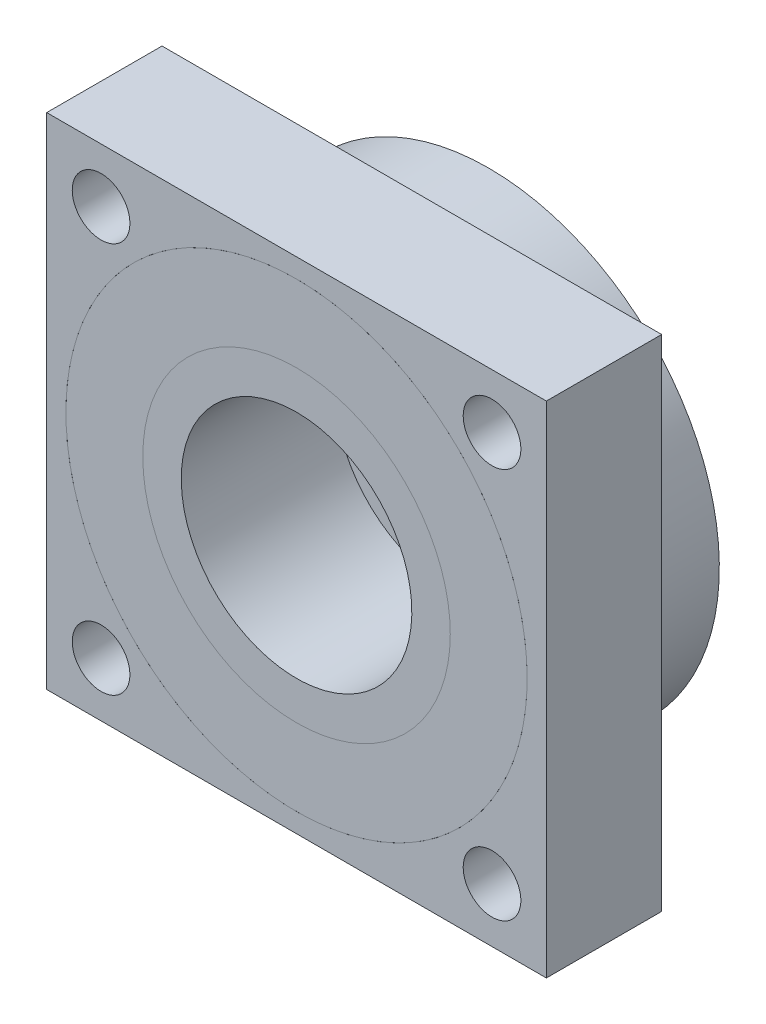
ISO-10303-21;
HEADER;
FILE_DESCRIPTION(('STEP AP214'),'2;1');
FILE_NAME('part.step','',(''),(''),'','','');
FILE_SCHEMA(('AUTOMOTIVE_DESIGN { 1 0 10303 214 1 1 1 1 }'));
ENDSEC;
DATA;
#1=APPLICATION_CONTEXT('core data for automotive mechanical design processes');
#2=APPLICATION_PROTOCOL_DEFINITION('international standard','automotive_design',2000,#1);
#3=PRODUCT_CONTEXT('',#1,'mechanical');
#4=PRODUCT('Part','Part','',(#3));
#5=PRODUCT_RELATED_PRODUCT_CATEGORY('part','',(#4));
#6=PRODUCT_DEFINITION_FORMATION('','',#4);
#7=PRODUCT_DEFINITION_CONTEXT('part definition',#1,'design');
#8=PRODUCT_DEFINITION('design','',#6,#7);
#9=PRODUCT_DEFINITION_SHAPE('','',#8);
#10=(LENGTH_UNIT() NAMED_UNIT(*) SI_UNIT(.MILLI.,.METRE.));
#11=(NAMED_UNIT(*) PLANE_ANGLE_UNIT() SI_UNIT($,.RADIAN.));
#12=(NAMED_UNIT(*) SI_UNIT($,.STERADIAN.) SOLID_ANGLE_UNIT());
#13=UNCERTAINTY_MEASURE_WITH_UNIT(LENGTH_MEASURE(1.E-05),#10,'distance_accuracy_value','');
#14=(GEOMETRIC_REPRESENTATION_CONTEXT(3) GLOBAL_UNCERTAINTY_ASSIGNED_CONTEXT((#13)) GLOBAL_UNIT_ASSIGNED_CONTEXT((#10,
#11,#12)) REPRESENTATION_CONTEXT('',''));
#15=CARTESIAN_POINT('',(0.,0.,0.));
#16=DIRECTION('',(0.,0.,1.));
#17=DIRECTION('',(1.,0.,0.));
#18=AXIS2_PLACEMENT_3D('',#15,#16,#17);
#19=CARTESIAN_POINT('',(0.,0.,-12.7));
#20=DIRECTION('',(0.,0.,-1.));
#21=DIRECTION('',(0.,1.,0.));
#22=AXIS2_PLACEMENT_3D('',#19,#20,#21);
#23=CYLINDRICAL_SURFACE('',#22,7.62);
#24=CARTESIAN_POINT('',(0.,0.,0.));
#25=DIRECTION('',(0.,0.,-1.));
#26=DIRECTION('',(0.,1.,0.));
#27=AXIS2_PLACEMENT_3D('',#24,#25,#26);
#28=CIRCLE('',#27,7.62);
#29=CARTESIAN_POINT('',(0.,7.62,0.));
#30=VERTEX_POINT('',#29);
#31=EDGE_CURVE('E11',#30,#30,#28,.T.);
#32=ORIENTED_EDGE('',*,*,#31,.F.);
#33=EDGE_LOOP('',(#32));
#34=FACE_BOUND('',#33,.T.);
#35=CARTESIAN_POINT('',(0.,0.,-10.16));
#36=DIRECTION('',(0.,0.,-1.));
#37=DIRECTION('',(0.,1.,0.));
#38=AXIS2_PLACEMENT_3D('',#35,#36,#37);
#39=CIRCLE('',#38,7.62);
#40=CARTESIAN_POINT('',(0.,7.62,-10.16));
#41=VERTEX_POINT('',#40);
#42=EDGE_CURVE('E62',#41,#41,#39,.T.);
#43=ORIENTED_EDGE('',*,*,#42,.T.);
#44=EDGE_LOOP('',(#43));
#45=FACE_BOUND('',#44,.T.);
#46=ADVANCED_FACE('F47',(#34,#45),#23,.F.);
#47=CARTESIAN_POINT('',(0.,0.,0.));
#48=DIRECTION('',(0.,0.,1.));
#49=DIRECTION('',(0.,-1.,0.));
#50=AXIS2_PLACEMENT_3D('',#47,#48,#49);
#51=PLANE('',#50);
#52=ORIENTED_EDGE('',*,*,#31,.T.);
#53=EDGE_LOOP('',(#52));
#54=FACE_BOUND('',#53,.T.);
#55=CARTESIAN_POINT('',(0.,0.,0.));
#56=DIRECTION('',(0.,0.,-1.));
#57=DIRECTION('',(0.,1.,0.));
#58=AXIS2_PLACEMENT_3D('',#55,#56,#57);
#59=CIRCLE('',#58,10.16);
#60=CARTESIAN_POINT('',(0.,10.16,0.));
#61=VERTEX_POINT('',#60);
#62=EDGE_CURVE('E58',#61,#61,#59,.T.);
#63=ORIENTED_EDGE('',*,*,#62,.F.);
#64=EDGE_LOOP('',(#63));
#65=FACE_BOUND('',#64,.T.);
#66=ADVANCED_FACE('F49',(#54,#65),#51,.T.);
#67=CARTESIAN_POINT('',(0.,0.,-12.7));
#68=DIRECTION('',(0.,0.,-1.));
#69=DIRECTION('',(0.,1.,0.));
#70=AXIS2_PLACEMENT_3D('',#67,#68,#69);
#71=PLANE('',#70);
#72=CARTESIAN_POINT('',(0.,0.,-12.7));
#73=DIRECTION('',(0.,0.,-1.));
#74=DIRECTION('',(0.,1.,0.));
#75=AXIS2_PLACEMENT_3D('',#72,#73,#74);
#76=CIRCLE('',#75,10.16);
#77=CARTESIAN_POINT('',(0.,10.16,-12.7));
#78=VERTEX_POINT('',#77);
#79=EDGE_CURVE('E54',#78,#78,#76,.T.);
#80=ORIENTED_EDGE('',*,*,#79,.T.);
#81=EDGE_LOOP('',(#80));
#82=FACE_BOUND('',#81,.T.);
#83=ADVANCED_FACE('F76',(#82),#71,.T.);
#84=CARTESIAN_POINT('',(0.,0.,-12.7));
#85=DIRECTION('',(0.,0.,-1.));
#86=DIRECTION('',(0.,1.,0.));
#87=AXIS2_PLACEMENT_3D('',#84,#85,#86);
#88=CYLINDRICAL_SURFACE('',#87,10.16);
#89=ORIENTED_EDGE('',*,*,#79,.F.);
#90=EDGE_LOOP('',(#89));
#91=FACE_BOUND('',#90,.T.);
#92=ORIENTED_EDGE('',*,*,#62,.T.);
#93=EDGE_LOOP('',(#92));
#94=FACE_BOUND('',#93,.T.);
#95=ADVANCED_FACE('F71',(#91,#94),#88,.T.);
#96=CARTESIAN_POINT('',(0.,0.,-10.16));
#97=DIRECTION('',(0.,0.,-1.));
#98=DIRECTION('',(0.,1.,0.));
#99=AXIS2_PLACEMENT_3D('',#96,#97,#98);
#100=PLANE('',#99);
#101=ORIENTED_EDGE('',*,*,#42,.F.);
#102=EDGE_LOOP('',(#101));
#103=FACE_BOUND('',#102,.T.);
#104=ADVANCED_FACE('F69',(#103),#100,.F.);
#105=CLOSED_SHELL('',(#46,#66,#83,#95,#104));
#106=MANIFOLD_SOLID_BREP('B2',#105);
#107=CARTESIAN_POINT('',(16.51,16.51,-7.62));
#108=DIRECTION('',(1.,0.,0.));
#109=DIRECTION('',(0.,1.,0.));
#110=AXIS2_PLACEMENT_3D('',#107,#108,#109);
#111=PLANE('',#110);
#112=DIRECTION('',(0.,1.,0.));
#113=VECTOR('',#112,1.);
#114=CARTESIAN_POINT('',(16.51,16.51,0.));
#115=LINE('',#114,#113);
#116=CARTESIAN_POINT('',(16.51,-16.51,0.));
#117=VERTEX_POINT('',#116);
#118=CARTESIAN_POINT('',(16.51,16.51,0.));
#119=VERTEX_POINT('',#118);
#120=EDGE_CURVE('E196',#117,#119,#115,.T.);
#121=ORIENTED_EDGE('',*,*,#120,.F.);
#122=DIRECTION('',(0.,0.,1.));
#123=VECTOR('',#122,1.);
#124=CARTESIAN_POINT('',(16.51,-16.51,-7.62));
#125=LINE('',#124,#123);
#126=CARTESIAN_POINT('',(16.51,-16.51,-7.62));
#127=VERTEX_POINT('',#126);
#128=EDGE_CURVE('E45',#127,#117,#125,.T.);
#129=ORIENTED_EDGE('',*,*,#128,.F.);
#130=DIRECTION('',(0.,1.,0.));
#131=VECTOR('',#130,1.);
#132=CARTESIAN_POINT('',(16.51,16.51,-7.62));
#133=LINE('',#132,#131);
#134=CARTESIAN_POINT('',(16.51,16.51,-7.62));
#135=VERTEX_POINT('',#134);
#136=EDGE_CURVE('E189',#127,#135,#133,.T.);
#137=ORIENTED_EDGE('',*,*,#136,.T.);
#138=DIRECTION('',(0.,0.,1.));
#139=VECTOR('',#138,1.);
#140=CARTESIAN_POINT('',(16.51,16.51,-7.62));
#141=LINE('',#140,#139);
#142=EDGE_CURVE('E134',#135,#119,#141,.T.);
#143=ORIENTED_EDGE('',*,*,#142,.T.);
#144=EDGE_LOOP('',(#121,#129,#137,#143));
#145=FACE_BOUND('',#144,.T.);
#146=ADVANCED_FACE('F131',(#145),#111,.T.);
#147=CARTESIAN_POINT('',(-16.51,-16.51,-7.62));
#148=DIRECTION('',(0.,-1.,0.));
#149=DIRECTION('',(0.,0.,-1.));
#150=AXIS2_PLACEMENT_3D('',#147,#148,#149);
#151=PLANE('',#150);
#152=DIRECTION('',(1.,0.,0.));
#153=VECTOR('',#152,1.);
#154=CARTESIAN_POINT('',(-16.51,-16.51,0.));
#155=LINE('',#154,#153);
#156=CARTESIAN_POINT('',(-16.51,-16.51,0.));
#157=VERTEX_POINT('',#156);
#158=EDGE_CURVE('E191',#157,#117,#155,.T.);
#159=ORIENTED_EDGE('',*,*,#158,.F.);
#160=DIRECTION('',(0.,0.,1.));
#161=VECTOR('',#160,1.);
#162=CARTESIAN_POINT('',(-16.51,-16.51,-7.62));
#163=LINE('',#162,#161);
#164=CARTESIAN_POINT('',(-16.51,-16.51,-7.62));
#165=VERTEX_POINT('',#164);
#166=EDGE_CURVE('E140',#165,#157,#163,.T.);
#167=ORIENTED_EDGE('',*,*,#166,.F.);
#168=DIRECTION('',(1.,0.,0.));
#169=VECTOR('',#168,1.);
#170=CARTESIAN_POINT('',(-16.51,-16.51,-7.62));
#171=LINE('',#170,#169);
#172=EDGE_CURVE('E186',#165,#127,#171,.T.);
#173=ORIENTED_EDGE('',*,*,#172,.T.);
#174=ORIENTED_EDGE('',*,*,#128,.T.);
#175=EDGE_LOOP('',(#159,#167,#173,#174));
#176=FACE_BOUND('',#175,.T.);
#177=ADVANCED_FACE('F207',(#176),#151,.T.);
#178=CARTESIAN_POINT('',(-16.51,16.51,-7.62));
#179=DIRECTION('',(-1.,0.,0.));
#180=DIRECTION('',(0.,0.,1.));
#181=AXIS2_PLACEMENT_3D('',#178,#179,#180);
#182=PLANE('',#181);
#183=DIRECTION('',(0.,-1.,0.));
#184=VECTOR('',#183,1.);
#185=CARTESIAN_POINT('',(-16.51,16.51,0.));
#186=LINE('',#185,#184);
#187=CARTESIAN_POINT('',(-16.51,16.51,0.));
#188=VERTEX_POINT('',#187);
#189=EDGE_CURVE('E181',#188,#157,#186,.T.);
#190=ORIENTED_EDGE('',*,*,#189,.F.);
#191=DIRECTION('',(0.,0.,1.));
#192=VECTOR('',#191,1.);
#193=CARTESIAN_POINT('',(-16.51,16.51,-7.62));
#194=LINE('',#193,#192);
#195=CARTESIAN_POINT('',(-16.51,16.51,-7.62));
#196=VERTEX_POINT('',#195);
#197=EDGE_CURVE('E176',#196,#188,#194,.T.);
#198=ORIENTED_EDGE('',*,*,#197,.F.);
#199=DIRECTION('',(0.,-1.,0.));
#200=VECTOR('',#199,1.);
#201=CARTESIAN_POINT('',(-16.51,16.51,-7.62));
#202=LINE('',#201,#200);
#203=EDGE_CURVE('E179',#196,#165,#202,.T.);
#204=ORIENTED_EDGE('',*,*,#203,.T.);
#205=ORIENTED_EDGE('',*,*,#166,.T.);
#206=EDGE_LOOP('',(#190,#198,#204,#205));
#207=FACE_BOUND('',#206,.T.);
#208=ADVANCED_FACE('F178',(#207),#182,.T.);
#209=CARTESIAN_POINT('',(-16.51,16.51,-7.62));
#210=DIRECTION('',(0.,1.,0.));
#211=DIRECTION('',(0.,0.,1.));
#212=AXIS2_PLACEMENT_3D('',#209,#210,#211);
#213=PLANE('',#212);
#214=DIRECTION('',(-1.,0.,0.));
#215=VECTOR('',#214,1.);
#216=CARTESIAN_POINT('',(-16.51,16.51,0.));
#217=LINE('',#216,#215);
#218=EDGE_CURVE('E199',#119,#188,#217,.T.);
#219=ORIENTED_EDGE('',*,*,#218,.F.);
#220=ORIENTED_EDGE('',*,*,#142,.F.);
#221=DIRECTION('',(-1.,0.,0.));
#222=VECTOR('',#221,1.);
#223=CARTESIAN_POINT('',(-16.51,16.51,-7.62));
#224=LINE('',#223,#222);
#225=EDGE_CURVE('E185',#135,#196,#224,.T.);
#226=ORIENTED_EDGE('',*,*,#225,.T.);
#227=ORIENTED_EDGE('',*,*,#197,.T.);
#228=EDGE_LOOP('',(#219,#220,#226,#227));
#229=FACE_BOUND('',#228,.T.);
#230=ADVANCED_FACE('F188',(#229),#213,.T.);
#231=CARTESIAN_POINT('',(0.,0.,-7.62));
#232=DIRECTION('',(0.,0.,1.));
#233=DIRECTION('',(1.,0.,0.));
#234=AXIS2_PLACEMENT_3D('',#231,#232,#233);
#235=PLANE('',#234);
#236=CARTESIAN_POINT('',(12.9178975515716,-12.9178975515723,-7.62));
#237=DIRECTION('',(0.,0.,-1.));
#238=DIRECTION('',(-1.,0.,0.));
#239=AXIS2_PLACEMENT_3D('',#236,#237,#238);
#240=CIRCLE('',#239,1.90500000000038);
#241=CARTESIAN_POINT('',(11.0128975515712,-12.9178975515723,-7.62));
#242=VERTEX_POINT('',#241);
#243=EDGE_CURVE('E271',#242,#242,#240,.T.);
#244=ORIENTED_EDGE('',*,*,#243,.F.);
#245=EDGE_LOOP('',(#244));
#246=FACE_BOUND('',#245,.T.);
#247=CARTESIAN_POINT('',(-12.9178975515731,-12.9178975515716,-7.62));
#248=DIRECTION('',(0.,0.,-1.));
#249=DIRECTION('',(-1.,0.,0.));
#250=AXIS2_PLACEMENT_3D('',#247,#248,#249);
#251=CIRCLE('',#250,1.90500000000102);
#252=CARTESIAN_POINT('',(-14.8228975515741,-12.9178975515716,-7.62));
#253=VERTEX_POINT('',#252);
#254=EDGE_CURVE('E263',#253,#253,#251,.T.);
#255=ORIENTED_EDGE('',*,*,#254,.F.);
#256=EDGE_LOOP('',(#255));
#257=FACE_BOUND('',#256,.T.);
#258=CARTESIAN_POINT('',(-12.9178975515723,12.9178975515731,-7.62));
#259=DIRECTION('',(0.,0.,-1.));
#260=DIRECTION('',(-1.,0.,0.));
#261=AXIS2_PLACEMENT_3D('',#258,#259,#260);
#262=CIRCLE('',#261,1.90500000000075);
#263=CARTESIAN_POINT('',(-14.8228975515731,12.9178975515731,-7.62));
#264=VERTEX_POINT('',#263);
#265=EDGE_CURVE('E256',#264,#264,#262,.T.);
#266=ORIENTED_EDGE('',*,*,#265,.F.);
#267=EDGE_LOOP('',(#266));
#268=FACE_BOUND('',#267,.T.);
#269=CARTESIAN_POINT('',(12.9178975515723,12.9178975515723,-7.62));
#270=DIRECTION('',(0.,0.,-1.));
#271=DIRECTION('',(-1.,0.,0.));
#272=AXIS2_PLACEMENT_3D('',#269,#270,#271);
#273=CIRCLE('',#272,1.905);
#274=CARTESIAN_POINT('',(11.0128975515723,12.9178975515723,-7.62));
#275=VERTEX_POINT('',#274);
#276=EDGE_CURVE('E260',#275,#275,#273,.T.);
#277=ORIENTED_EDGE('',*,*,#276,.F.);
#278=EDGE_LOOP('',(#277));
#279=FACE_BOUND('',#278,.T.);
#280=CARTESIAN_POINT('',(0.,0.,-7.62));
#281=DIRECTION('',(0.,0.,1.));
#282=DIRECTION('',(1.,0.,0.));
#283=AXIS2_PLACEMENT_3D('',#280,#281,#282);
#284=CIRCLE('',#283,15.24);
#285=CARTESIAN_POINT('',(15.24,0.,-7.62));
#286=VERTEX_POINT('',#285);
#287=EDGE_CURVE('E200',#286,#286,#284,.T.);
#288=ORIENTED_EDGE('',*,*,#287,.T.);
#289=EDGE_LOOP('',(#288));
#290=FACE_BOUND('',#289,.T.);
#291=ORIENTED_EDGE('',*,*,#136,.F.);
#292=ORIENTED_EDGE('',*,*,#172,.F.);
#293=ORIENTED_EDGE('',*,*,#203,.F.);
#294=ORIENTED_EDGE('',*,*,#225,.F.);
#295=EDGE_LOOP('',(#291,#292,#293,#294));
#296=FACE_BOUND('',#295,.T.);
#297=ADVANCED_FACE('F184',(#246,#257,#268,#279,#290,#296),#235,.F.);
#298=CARTESIAN_POINT('',(0.,0.,0.));
#299=DIRECTION('',(0.,0.,1.));
#300=DIRECTION('',(1.,0.,0.));
#301=AXIS2_PLACEMENT_3D('',#298,#299,#300);
#302=PLANE('',#301);
#303=CARTESIAN_POINT('',(12.9178975515716,-12.9178975515723,0.));
#304=DIRECTION('',(0.,0.,-1.));
#305=DIRECTION('',(-1.,0.,0.));
#306=AXIS2_PLACEMENT_3D('',#303,#304,#305);
#307=CIRCLE('',#306,1.90500000000038);
#308=CARTESIAN_POINT('',(11.0128975515712,-12.9178975515723,0.));
#309=VERTEX_POINT('',#308);
#310=EDGE_CURVE('E268',#309,#309,#307,.T.);
#311=ORIENTED_EDGE('',*,*,#310,.T.);
#312=EDGE_LOOP('',(#311));
#313=FACE_BOUND('',#312,.T.);
#314=CARTESIAN_POINT('',(-12.9178975515731,-12.9178975515716,0.));
#315=DIRECTION('',(0.,0.,-1.));
#316=DIRECTION('',(-1.,0.,0.));
#317=AXIS2_PLACEMENT_3D('',#314,#315,#316);
#318=CIRCLE('',#317,1.90500000000102);
#319=CARTESIAN_POINT('',(-14.8228975515741,-12.9178975515716,0.));
#320=VERTEX_POINT('',#319);
#321=EDGE_CURVE('E258',#320,#320,#318,.T.);
#322=ORIENTED_EDGE('',*,*,#321,.T.);
#323=EDGE_LOOP('',(#322));
#324=FACE_BOUND('',#323,.T.);
#325=CARTESIAN_POINT('',(-12.9178975515723,12.9178975515731,0.));
#326=DIRECTION('',(0.,0.,-1.));
#327=DIRECTION('',(-1.,0.,0.));
#328=AXIS2_PLACEMENT_3D('',#325,#326,#327);
#329=CIRCLE('',#328,1.90500000000075);
#330=CARTESIAN_POINT('',(-14.8228975515731,12.9178975515731,0.));
#331=VERTEX_POINT('',#330);
#332=EDGE_CURVE('E253',#331,#331,#329,.T.);
#333=ORIENTED_EDGE('',*,*,#332,.T.);
#334=EDGE_LOOP('',(#333));
#335=FACE_BOUND('',#334,.T.);
#336=CARTESIAN_POINT('',(12.9178975515723,12.9178975515723,0.));
#337=DIRECTION('',(0.,0.,-1.));
#338=DIRECTION('',(-1.,0.,0.));
#339=AXIS2_PLACEMENT_3D('',#336,#337,#338);
#340=CIRCLE('',#339,1.905);
#341=CARTESIAN_POINT('',(11.0128975515723,12.9178975515723,0.));
#342=VERTEX_POINT('',#341);
#343=EDGE_CURVE('E274',#342,#342,#340,.T.);
#344=ORIENTED_EDGE('',*,*,#343,.T.);
#345=EDGE_LOOP('',(#344));
#346=FACE_BOUND('',#345,.T.);
#347=CARTESIAN_POINT('',(0.,0.,0.));
#348=DIRECTION('',(0.,0.,1.));
#349=DIRECTION('',(1.,0.,0.));
#350=AXIS2_PLACEMENT_3D('',#347,#348,#349);
#351=CIRCLE('',#350,15.24);
#352=CARTESIAN_POINT('',(15.24,0.,0.));
#353=VERTEX_POINT('',#352);
#354=EDGE_CURVE('E277',#353,#353,#351,.T.);
#355=ORIENTED_EDGE('',*,*,#354,.F.);
#356=EDGE_LOOP('',(#355));
#357=FACE_BOUND('',#356,.T.);
#358=ORIENTED_EDGE('',*,*,#120,.T.);
#359=ORIENTED_EDGE('',*,*,#218,.T.);
#360=ORIENTED_EDGE('',*,*,#189,.T.);
#361=ORIENTED_EDGE('',*,*,#158,.T.);
#362=EDGE_LOOP('',(#358,#359,#360,#361));
#363=FACE_BOUND('',#362,.T.);
#364=ADVANCED_FACE('F206',(#313,#324,#335,#346,#357,#363),#302,.T.);
#365=CARTESIAN_POINT('',(0.,0.,-7.62));
#366=DIRECTION('',(0.,0.,1.));
#367=DIRECTION('',(1.,0.,0.));
#368=AXIS2_PLACEMENT_3D('',#365,#366,#367);
#369=CYLINDRICAL_SURFACE('',#368,15.24);
#370=ORIENTED_EDGE('',*,*,#287,.F.);
#371=EDGE_LOOP('',(#370));
#372=FACE_BOUND('',#371,.T.);
#373=ORIENTED_EDGE('',*,*,#354,.T.);
#374=EDGE_LOOP('',(#373));
#375=FACE_BOUND('',#374,.T.);
#376=ADVANCED_FACE('F225',(#372,#375),#369,.F.);
#377=CARTESIAN_POINT('',(12.9178975515723,12.9178975515723,0.));
#378=DIRECTION('',(0.,0.,-1.));
#379=DIRECTION('',(-1.,0.,0.));
#380=AXIS2_PLACEMENT_3D('',#377,#378,#379);
#381=CYLINDRICAL_SURFACE('',#380,1.905);
#382=ORIENTED_EDGE('',*,*,#343,.F.);
#383=EDGE_LOOP('',(#382));
#384=FACE_BOUND('',#383,.T.);
#385=ORIENTED_EDGE('',*,*,#276,.T.);
#386=EDGE_LOOP('',(#385));
#387=FACE_BOUND('',#386,.T.);
#388=ADVANCED_FACE('F232',(#384,#387),#381,.F.);
#389=CARTESIAN_POINT('',(-12.9178975515723,12.9178975515731,0.));
#390=DIRECTION('',(0.,0.,-1.));
#391=DIRECTION('',(-1.,0.,0.));
#392=AXIS2_PLACEMENT_3D('',#389,#390,#391);
#393=CYLINDRICAL_SURFACE('',#392,1.90500000000075);
#394=ORIENTED_EDGE('',*,*,#332,.F.);
#395=EDGE_LOOP('',(#394));
#396=FACE_BOUND('',#395,.T.);
#397=ORIENTED_EDGE('',*,*,#265,.T.);
#398=EDGE_LOOP('',(#397));
#399=FACE_BOUND('',#398,.T.);
#400=ADVANCED_FACE('F236',(#396,#399),#393,.F.);
#401=CARTESIAN_POINT('',(-12.9178975515731,-12.9178975515716,0.));
#402=DIRECTION('',(0.,0.,-1.));
#403=DIRECTION('',(-1.,0.,0.));
#404=AXIS2_PLACEMENT_3D('',#401,#402,#403);
#405=CYLINDRICAL_SURFACE('',#404,1.90500000000102);
#406=ORIENTED_EDGE('',*,*,#321,.F.);
#407=EDGE_LOOP('',(#406));
#408=FACE_BOUND('',#407,.T.);
#409=ORIENTED_EDGE('',*,*,#254,.T.);
#410=EDGE_LOOP('',(#409));
#411=FACE_BOUND('',#410,.T.);
#412=ADVANCED_FACE('F241',(#408,#411),#405,.F.);
#413=CARTESIAN_POINT('',(12.9178975515716,-12.9178975515723,0.));
#414=DIRECTION('',(0.,0.,-1.));
#415=DIRECTION('',(-1.,0.,0.));
#416=AXIS2_PLACEMENT_3D('',#413,#414,#415);
#417=CYLINDRICAL_SURFACE('',#416,1.90500000000038);
#418=ORIENTED_EDGE('',*,*,#310,.F.);
#419=EDGE_LOOP('',(#418));
#420=FACE_BOUND('',#419,.T.);
#421=ORIENTED_EDGE('',*,*,#243,.T.);
#422=EDGE_LOOP('',(#421));
#423=FACE_BOUND('',#422,.T.);
#424=ADVANCED_FACE('F238',(#420,#423),#417,.F.);
#425=CLOSED_SHELL('',(#146,#177,#208,#230,#297,#364,#376,#388,#400,#412,#424));
#426=MANIFOLD_SOLID_BREP('B6',#425);
#427=CARTESIAN_POINT('',(0.,0.,-12.7));
#428=DIRECTION('',(0.,0.,1.));
#429=DIRECTION('',(0.,-1.,0.));
#430=AXIS2_PLACEMENT_3D('',#427,#428,#429);
#431=PLANE('',#430);
#432=CARTESIAN_POINT('',(0.,0.,-12.7));
#433=DIRECTION('',(0.,0.,-1.));
#434=DIRECTION('',(0.,1.,0.));
#435=AXIS2_PLACEMENT_3D('',#432,#433,#434);
#436=CIRCLE('',#435,10.16);
#437=CARTESIAN_POINT('',(0.,10.16,-12.7));
#438=VERTEX_POINT('',#437);
#439=EDGE_CURVE('E373',#438,#438,#436,.T.);
#440=ORIENTED_EDGE('',*,*,#439,.F.);
#441=EDGE_LOOP('',(#440));
#442=FACE_BOUND('',#441,.T.);
#443=CARTESIAN_POINT('',(0.,0.,-12.7));
#444=DIRECTION('',(0.,0.,-1.));
#445=DIRECTION('',(0.,1.,0.));
#446=AXIS2_PLACEMENT_3D('',#443,#444,#445);
#447=CIRCLE('',#446,15.24);
#448=CARTESIAN_POINT('',(0.,15.24,-12.7));
#449=VERTEX_POINT('',#448);
#450=EDGE_CURVE('E130',#449,#449,#447,.T.);
#451=ORIENTED_EDGE('',*,*,#450,.T.);
#452=EDGE_LOOP('',(#451));
#453=FACE_BOUND('',#452,.T.);
#454=ADVANCED_FACE('F359',(#442,#453),#431,.F.);
#455=CARTESIAN_POINT('',(0.,0.,-12.7));
#456=DIRECTION('',(0.,0.,-1.));
#457=DIRECTION('',(0.,1.,0.));
#458=AXIS2_PLACEMENT_3D('',#455,#456,#457);
#459=CYLINDRICAL_SURFACE('',#458,15.24);
#460=ORIENTED_EDGE('',*,*,#450,.F.);
#461=EDGE_LOOP('',(#460));
#462=FACE_BOUND('',#461,.T.);
#463=CARTESIAN_POINT('',(0.,0.,0.));
#464=DIRECTION('',(0.,0.,-1.));
#465=DIRECTION('',(0.,1.,0.));
#466=AXIS2_PLACEMENT_3D('',#463,#464,#465);
#467=CIRCLE('',#466,15.24);
#468=CARTESIAN_POINT('',(0.,15.24,0.));
#469=VERTEX_POINT('',#468);
#470=EDGE_CURVE('E365',#469,#469,#467,.T.);
#471=ORIENTED_EDGE('',*,*,#470,.T.);
#472=EDGE_LOOP('',(#471));
#473=FACE_BOUND('',#472,.T.);
#474=ADVANCED_FACE('F382',(#462,#473),#459,.T.);
#475=CARTESIAN_POINT('',(0.,0.,0.));
#476=DIRECTION('',(0.,0.,-1.));
#477=DIRECTION('',(0.,1.,0.));
#478=AXIS2_PLACEMENT_3D('',#475,#476,#477);
#479=PLANE('',#478);
#480=ORIENTED_EDGE('',*,*,#470,.F.);
#481=EDGE_LOOP('',(#480));
#482=FACE_BOUND('',#481,.T.);
#483=CARTESIAN_POINT('',(0.,0.,0.));
#484=DIRECTION('',(0.,0.,-1.));
#485=DIRECTION('',(0.,1.,0.));
#486=AXIS2_PLACEMENT_3D('',#483,#484,#485);
#487=CIRCLE('',#486,10.16);
#488=CARTESIAN_POINT('',(0.,10.16,0.));
#489=VERTEX_POINT('',#488);
#490=EDGE_CURVE('E369',#489,#489,#487,.T.);
#491=ORIENTED_EDGE('',*,*,#490,.T.);
#492=EDGE_LOOP('',(#491));
#493=FACE_BOUND('',#492,.T.);
#494=ADVANCED_FACE('F386',(#482,#493),#479,.F.);
#495=CARTESIAN_POINT('',(0.,0.,-12.7));
#496=DIRECTION('',(0.,0.,-1.));
#497=DIRECTION('',(0.,1.,0.));
#498=AXIS2_PLACEMENT_3D('',#495,#496,#497);
#499=CYLINDRICAL_SURFACE('',#498,10.16);
#500=ORIENTED_EDGE('',*,*,#490,.F.);
#501=EDGE_LOOP('',(#500));
#502=FACE_BOUND('',#501,.T.);
#503=ORIENTED_EDGE('',*,*,#439,.T.);
#504=EDGE_LOOP('',(#503));
#505=FACE_BOUND('',#504,.T.);
#506=ADVANCED_FACE('F379',(#502,#505),#499,.F.);
#507=CLOSED_SHELL('',(#454,#474,#494,#506));
#508=MANIFOLD_SOLID_BREP('B39',#507);
#509=ADVANCED_BREP_SHAPE_REPRESENTATION('',(#18,#106,#426,#508),#14);
#510=SHAPE_DEFINITION_REPRESENTATION(#9,#509);
ENDSEC;
END-ISO-10303-21;
